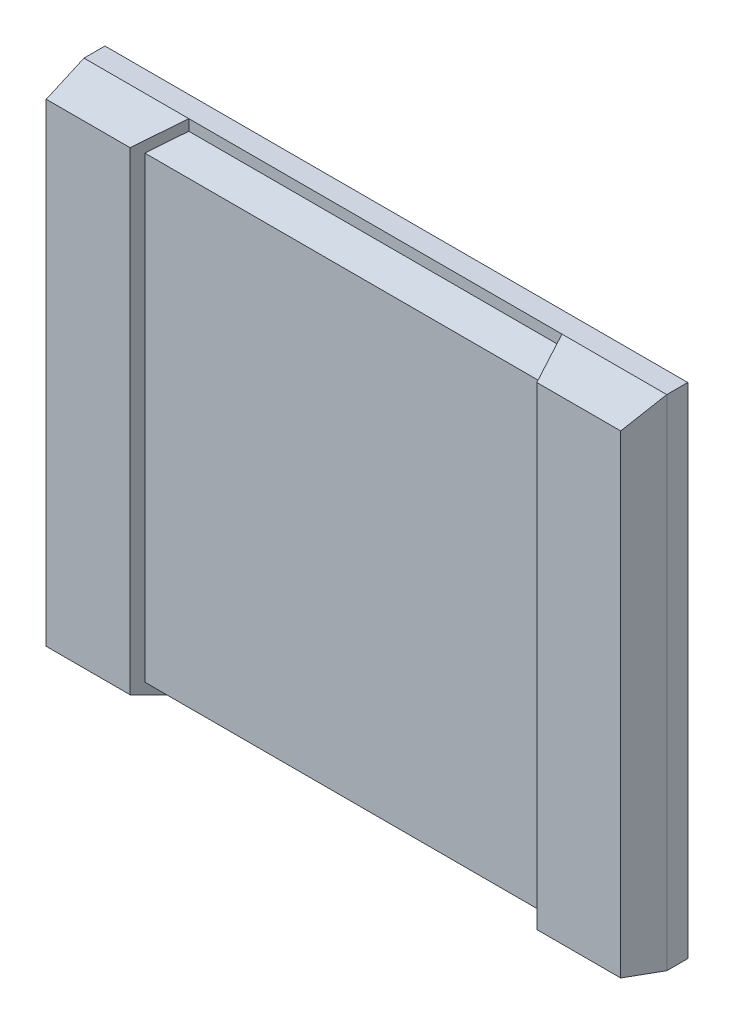
ISO-10303-21;
HEADER;
FILE_DESCRIPTION(('STEP AP214'),'2;1');
FILE_NAME('part.step','',(''),(''),'','','');
FILE_SCHEMA(('AUTOMOTIVE_DESIGN { 1 0 10303 214 1 1 1 1 }'));
ENDSEC;
DATA;
#1=APPLICATION_CONTEXT('core data for automotive mechanical design processes');
#2=APPLICATION_PROTOCOL_DEFINITION('international standard','automotive_design',2000,#1);
#3=PRODUCT_CONTEXT('',#1,'mechanical');
#4=PRODUCT('Part','Part','',(#3));
#5=PRODUCT_RELATED_PRODUCT_CATEGORY('part','',(#4));
#6=PRODUCT_DEFINITION_FORMATION('','',#4);
#7=PRODUCT_DEFINITION_CONTEXT('part definition',#1,'design');
#8=PRODUCT_DEFINITION('design','',#6,#7);
#9=PRODUCT_DEFINITION_SHAPE('','',#8);
#10=(LENGTH_UNIT() NAMED_UNIT(*) SI_UNIT(.MILLI.,.METRE.));
#11=(NAMED_UNIT(*) PLANE_ANGLE_UNIT() SI_UNIT($,.RADIAN.));
#12=(NAMED_UNIT(*) SI_UNIT($,.STERADIAN.) SOLID_ANGLE_UNIT());
#13=UNCERTAINTY_MEASURE_WITH_UNIT(LENGTH_MEASURE(1.E-05),#10,'distance_accuracy_value','');
#14=(GEOMETRIC_REPRESENTATION_CONTEXT(3) GLOBAL_UNCERTAINTY_ASSIGNED_CONTEXT((#13)) GLOBAL_UNIT_ASSIGNED_CONTEXT((#10,
#11,#12)) REPRESENTATION_CONTEXT('',''));
#15=CARTESIAN_POINT('',(0.,0.,0.));
#16=DIRECTION('',(0.,0.,1.));
#17=DIRECTION('',(1.,0.,0.));
#18=AXIS2_PLACEMENT_3D('',#15,#16,#17);
#19=CARTESIAN_POINT('',(0.,0.,15.));
#20=DIRECTION('',(0.,0.,1.));
#21=DIRECTION('',(1.,0.,0.));
#22=AXIS2_PLACEMENT_3D('',#19,#20,#21);
#23=PLANE('',#22);
#24=DIRECTION('',(1.,0.,0.));
#25=VECTOR('',#24,1.);
#26=CARTESIAN_POINT('',(-68.5,-56.5,15.));
#27=LINE('',#26,#25);
#28=CARTESIAN_POINT('',(-68.5,-56.5,15.));
#29=VERTEX_POINT('',#28);
#30=CARTESIAN_POINT('',(-48.5,-56.5,15.));
#31=VERTEX_POINT('',#30);
#32=EDGE_CURVE('E166',#29,#31,#27,.T.);
#33=ORIENTED_EDGE('',*,*,#32,.T.);
#34=DIRECTION('',(0.,1.,0.));
#35=VECTOR('',#34,1.);
#36=CARTESIAN_POINT('',(-48.5,-46.7709828525953,15.));
#37=LINE('',#36,#35);
#38=CARTESIAN_POINT('',(-48.5,56.5,15.));
#39=VERTEX_POINT('',#38);
#40=EDGE_CURVE('E147',#31,#39,#37,.T.);
#41=ORIENTED_EDGE('',*,*,#40,.T.);
#42=DIRECTION('',(-1.,0.,0.));
#43=VECTOR('',#42,1.);
#44=CARTESIAN_POINT('',(-68.5,56.5,15.));
#45=LINE('',#44,#43);
#46=CARTESIAN_POINT('',(-68.5,56.5,15.));
#47=VERTEX_POINT('',#46);
#48=EDGE_CURVE('E229',#39,#47,#45,.T.);
#49=ORIENTED_EDGE('',*,*,#48,.T.);
#50=DIRECTION('',(0.,-1.,0.));
#51=VECTOR('',#50,1.);
#52=CARTESIAN_POINT('',(-68.5,56.5,15.));
#53=LINE('',#52,#51);
#54=EDGE_CURVE('E176',#47,#29,#53,.T.);
#55=ORIENTED_EDGE('',*,*,#54,.T.);
#56=EDGE_LOOP('',(#33,#41,#49,#55));
#57=FACE_BOUND('',#56,.T.);
#58=ADVANCED_FACE('F45',(#57),#23,.T.);
#59=CARTESIAN_POINT('',(0.,53.5687370392407,16.0706211117723));
#60=DIRECTION('',(0.,-0.957826285221151,-0.287347885566347));
#61=DIRECTION('',(0.,0.287347885566347,-0.957826285221151));
#62=AXIS2_PLACEMENT_3D('',#59,#60,#61);
#63=PLANE('',#62);
#64=DIRECTION('',(-1.,0.,0.));
#65=VECTOR('',#64,1.);
#66=CARTESIAN_POINT('',(0.,54.6399233727724,12.5));
#67=LINE('',#66,#65);
#68=CARTESIAN_POINT('',(47.5,54.6399233727723,12.5));
#69=VERTEX_POINT('',#68);
#70=CARTESIAN_POINT('',(-47.5,54.6399233727723,12.5));
#71=VERTEX_POINT('',#70);
#72=EDGE_CURVE('E234',#69,#71,#67,.T.);
#73=ORIENTED_EDGE('',*,*,#72,.F.);
#74=DIRECTION('',(-0.357770876399965,0.268328157299976,-0.894427190999916));
#75=VECTOR('',#74,1.);
#76=CARTESIAN_POINT('',(58.1634469976353,46.6423381245458,39.1586174940884));
#77=LINE('',#76,#75);
#78=CARTESIAN_POINT('',(44.5,56.8899233727724,5.));
#79=VERTEX_POINT('',#78);
#80=EDGE_CURVE('E62',#69,#79,#77,.T.);
#81=ORIENTED_EDGE('',*,*,#80,.T.);
#82=DIRECTION('',(-1.,0.,0.));
#83=VECTOR('',#82,1.);
#84=CARTESIAN_POINT('',(44.5,56.8899233727724,5.));
#85=LINE('',#84,#83);
#86=CARTESIAN_POINT('',(-44.5,56.8899233727724,5.));
#87=VERTEX_POINT('',#86);
#88=EDGE_CURVE('E379',#79,#87,#85,.T.);
#89=ORIENTED_EDGE('',*,*,#88,.T.);
#90=DIRECTION('',(-0.357770876399966,-0.268328157299976,0.894427190999916));
#91=VECTOR('',#90,1.);
#92=CARTESIAN_POINT('',(-58.1634469976353,46.6423381245458,39.1586174940884));
#93=LINE('',#92,#91);
#94=EDGE_CURVE('E160',#87,#71,#93,.T.);
#95=ORIENTED_EDGE('',*,*,#94,.T.);
#96=EDGE_LOOP('',(#73,#81,#89,#95));
#97=FACE_BOUND('',#96,.T.);
#98=ADVANCED_FACE('F395',(#97),#63,.F.);
#99=CARTESIAN_POINT('',(0.,-53.5687370392407,16.0706211117723));
#100=DIRECTION('',(0.,0.957826285221151,-0.287347885566347));
#101=DIRECTION('',(0.,-0.287347885566347,-0.957826285221151));
#102=AXIS2_PLACEMENT_3D('',#99,#100,#101);
#103=PLANE('',#102);
#104=DIRECTION('',(1.,0.,0.));
#105=VECTOR('',#104,1.);
#106=CARTESIAN_POINT('',(0.,-54.6399233727724,12.5));
#107=LINE('',#106,#105);
#108=CARTESIAN_POINT('',(-47.5,-54.6399233727723,12.5));
#109=VERTEX_POINT('',#108);
#110=CARTESIAN_POINT('',(47.5,-54.6399233727723,12.5));
#111=VERTEX_POINT('',#110);
#112=EDGE_CURVE('E13',#109,#111,#107,.T.);
#113=ORIENTED_EDGE('',*,*,#112,.F.);
#114=DIRECTION('',(-0.357770876399966,0.268328157299976,0.894427190999916));
#115=VECTOR('',#114,1.);
#116=CARTESIAN_POINT('',(-58.1634469976353,-46.6423381245458,39.1586174940884));
#117=LINE('',#116,#115);
#118=CARTESIAN_POINT('',(-44.5,-56.8899233727724,5.));
#119=VERTEX_POINT('',#118);
#120=EDGE_CURVE('E172',#119,#109,#117,.T.);
#121=ORIENTED_EDGE('',*,*,#120,.F.);
#122=DIRECTION('',(-1.,0.,0.));
#123=VECTOR('',#122,1.);
#124=CARTESIAN_POINT('',(44.5,-56.8899233727724,5.));
#125=LINE('',#124,#123);
#126=CARTESIAN_POINT('',(44.5,-56.8899233727724,5.));
#127=VERTEX_POINT('',#126);
#128=EDGE_CURVE('E416',#127,#119,#125,.T.);
#129=ORIENTED_EDGE('',*,*,#128,.F.);
#130=DIRECTION('',(-0.357770876399965,-0.268328157299976,-0.894427190999916));
#131=VECTOR('',#130,1.);
#132=CARTESIAN_POINT('',(58.1634469976353,-46.6423381245458,39.1586174940884));
#133=LINE('',#132,#131);
#134=EDGE_CURVE('E411',#111,#127,#133,.T.);
#135=ORIENTED_EDGE('',*,*,#134,.F.);
#136=EDGE_LOOP('',(#113,#121,#129,#135));
#137=FACE_BOUND('',#136,.T.);
#138=ADVANCED_FACE('F399',(#137),#103,.F.);
#139=CARTESIAN_POINT('',(0.,-55.9633027522936,16.788990825688));
#140=DIRECTION('',(0.,0.957826285221152,-0.287347885566343));
#141=DIRECTION('',(0.,0.287347885566343,0.957826285221152));
#142=AXIS2_PLACEMENT_3D('',#139,#140,#141);
#143=PLANE('',#142);
#144=CARTESIAN_POINT('',(48.5,-56.5,15.));
#145=VERTEX_POINT('',#144);
#146=CARTESIAN_POINT('',(68.5,-56.5,15.));
#147=VERTEX_POINT('',#146);
#148=EDGE_CURVE('E178',#145,#147,#27,.T.);
#149=ORIENTED_EDGE('',*,*,#148,.F.);
#150=DIRECTION('',(0.357770876399965,0.268328157299976,0.894427190999916));
#151=VECTOR('',#150,1.);
#152=CARTESIAN_POINT('',(42.9160000000001,-60.688,1.04000000000012));
#153=LINE('',#152,#151);
#154=CARTESIAN_POINT('',(44.5,-59.5,5.));
#155=VERTEX_POINT('',#154);
#156=EDGE_CURVE('E171',#155,#145,#153,.T.);
#157=ORIENTED_EDGE('',*,*,#156,.F.);
#158=DIRECTION('',(1.,0.,0.));
#159=VECTOR('',#158,1.);
#160=CARTESIAN_POINT('',(0.,-59.5,5.));
#161=LINE('',#160,#159);
#162=CARTESIAN_POINT('',(69.5,-59.5,5.));
#163=VERTEX_POINT('',#162);
#164=EDGE_CURVE('E341',#155,#163,#161,.T.);
#165=ORIENTED_EDGE('',*,*,#164,.T.);
#166=DIRECTION('',(-0.0953462589245607,0.286038776773676,0.953462589245593));
#167=VECTOR('',#166,1.);
#168=CARTESIAN_POINT('',(69.5,-59.5,5.));
#169=LINE('',#168,#167);
#170=EDGE_CURVE('E254',#163,#147,#169,.T.);
#171=ORIENTED_EDGE('',*,*,#170,.T.);
#172=EDGE_LOOP('',(#149,#157,#165,#171));
#173=FACE_BOUND('',#172,.T.);
#174=ADVANCED_FACE('F306',(#173),#143,.F.);
#175=CARTESIAN_POINT('',(0.,55.9633027522935,16.7889908256882));
#176=DIRECTION('',(0.,-0.957826285221151,-0.287347885566347));
#177=DIRECTION('',(0.,0.287347885566347,-0.957826285221151));
#178=AXIS2_PLACEMENT_3D('',#175,#176,#177);
#179=PLANE('',#178);
#180=DIRECTION('',(1.,0.,0.));
#181=VECTOR('',#180,1.);
#182=CARTESIAN_POINT('',(0.,59.5,5.));
#183=LINE('',#182,#181);
#184=CARTESIAN_POINT('',(69.5,59.5,5.));
#185=VERTEX_POINT('',#184);
#186=CARTESIAN_POINT('',(44.5,59.5,5.));
#187=VERTEX_POINT('',#186);
#188=EDGE_CURVE('E342',#185,#187,#183,.F.);
#189=ORIENTED_EDGE('',*,*,#188,.T.);
#190=DIRECTION('',(0.357770876399965,-0.268328157299976,0.894427190999916));
#191=VECTOR('',#190,1.);
#192=CARTESIAN_POINT('',(42.9160000000001,60.688,1.04000000000012));
#193=LINE('',#192,#191);
#194=CARTESIAN_POINT('',(48.5,56.5,15.));
#195=VERTEX_POINT('',#194);
#196=EDGE_CURVE('E54',#187,#195,#193,.T.);
#197=ORIENTED_EDGE('',*,*,#196,.T.);
#198=CARTESIAN_POINT('',(68.5,56.5,15.));
#199=VERTEX_POINT('',#198);
#200=EDGE_CURVE('E249',#199,#195,#45,.T.);
#201=ORIENTED_EDGE('',*,*,#200,.F.);
#202=DIRECTION('',(-0.0953462589245606,-0.286038776773679,0.953462589245592));
#203=VECTOR('',#202,1.);
#204=CARTESIAN_POINT('',(69.5,59.5,5.));
#205=LINE('',#204,#203);
#206=EDGE_CURVE('E253',#185,#199,#205,.T.);
#207=ORIENTED_EDGE('',*,*,#206,.F.);
#208=EDGE_LOOP('',(#189,#197,#201,#207));
#209=FACE_BOUND('',#208,.T.);
#210=ADVANCED_FACE('F301',(#209),#179,.F.);
#211=CARTESIAN_POINT('',(69.5,59.5,5.));
#212=DIRECTION('',(-1.,0.,0.));
#213=DIRECTION('',(0.,0.,1.));
#214=AXIS2_PLACEMENT_3D('',#211,#212,#213);
#215=PLANE('',#214);
#216=DIRECTION('',(0.,1.,0.));
#217=VECTOR('',#216,1.);
#218=CARTESIAN_POINT('',(69.5,59.5,0.));
#219=LINE('',#218,#217);
#220=CARTESIAN_POINT('',(69.5,-59.5,0.));
#221=VERTEX_POINT('',#220);
#222=CARTESIAN_POINT('',(69.5,59.5,0.));
#223=VERTEX_POINT('',#222);
#224=EDGE_CURVE('E273',#221,#223,#219,.T.);
#225=ORIENTED_EDGE('',*,*,#224,.T.);
#226=DIRECTION('',(0.,0.,-1.));
#227=VECTOR('',#226,1.);
#228=CARTESIAN_POINT('',(69.5,59.5,5.));
#229=LINE('',#228,#227);
#230=EDGE_CURVE('E328',#185,#223,#229,.T.);
#231=ORIENTED_EDGE('',*,*,#230,.F.);
#232=DIRECTION('',(0.,1.,0.));
#233=VECTOR('',#232,1.);
#234=CARTESIAN_POINT('',(69.5,0.,5.));
#235=LINE('',#234,#233);
#236=EDGE_CURVE('E345',#163,#185,#235,.T.);
#237=ORIENTED_EDGE('',*,*,#236,.F.);
#238=DIRECTION('',(0.,0.,-1.));
#239=VECTOR('',#238,1.);
#240=CARTESIAN_POINT('',(69.5,-59.5,5.));
#241=LINE('',#240,#239);
#242=EDGE_CURVE('E348',#163,#221,#241,.T.);
#243=ORIENTED_EDGE('',*,*,#242,.T.);
#244=EDGE_LOOP('',(#225,#231,#237,#243));
#245=FACE_BOUND('',#244,.T.);
#246=ADVANCED_FACE('F47',(#245),#215,.F.);
#247=CARTESIAN_POINT('',(-69.5,59.5,5.));
#248=DIRECTION('',(0.,-1.,0.));
#249=DIRECTION('',(0.,0.,-1.));
#250=AXIS2_PLACEMENT_3D('',#247,#248,#249);
#251=PLANE('',#250);
#252=DIRECTION('',(-1.,0.,0.));
#253=VECTOR('',#252,1.);
#254=CARTESIAN_POINT('',(-69.5,59.5,0.));
#255=LINE('',#254,#253);
#256=CARTESIAN_POINT('',(-69.5,59.5,0.));
#257=VERTEX_POINT('',#256);
#258=EDGE_CURVE('E276',#223,#257,#255,.T.);
#259=ORIENTED_EDGE('',*,*,#258,.T.);
#260=DIRECTION('',(0.,0.,-1.));
#261=VECTOR('',#260,1.);
#262=CARTESIAN_POINT('',(-69.5,59.5,5.));
#263=LINE('',#262,#261);
#264=CARTESIAN_POINT('',(-69.5,59.5,5.));
#265=VERTEX_POINT('',#264);
#266=EDGE_CURVE('E330',#265,#257,#263,.T.);
#267=ORIENTED_EDGE('',*,*,#266,.F.);
#268=CARTESIAN_POINT('',(-44.5,59.5,5.));
#269=VERTEX_POINT('',#268);
#270=EDGE_CURVE('E271',#269,#265,#183,.F.);
#271=ORIENTED_EDGE('',*,*,#270,.F.);
#272=DIRECTION('',(-1.,0.,0.));
#273=VECTOR('',#272,1.);
#274=CARTESIAN_POINT('',(44.5,59.5,5.));
#275=LINE('',#274,#273);
#276=EDGE_CURVE('E365',#187,#269,#275,.T.);
#277=ORIENTED_EDGE('',*,*,#276,.F.);
#278=ORIENTED_EDGE('',*,*,#188,.F.);
#279=ORIENTED_EDGE('',*,*,#230,.T.);
#280=EDGE_LOOP('',(#259,#267,#271,#277,#278,#279));
#281=FACE_BOUND('',#280,.T.);
#282=ADVANCED_FACE('F364',(#281),#251,.F.);
#283=CARTESIAN_POINT('',(-69.5,59.5,5.));
#284=DIRECTION('',(1.,0.,0.));
#285=DIRECTION('',(0.,1.,0.));
#286=AXIS2_PLACEMENT_3D('',#283,#284,#285);
#287=PLANE('',#286);
#288=DIRECTION('',(0.,-1.,0.));
#289=VECTOR('',#288,1.);
#290=CARTESIAN_POINT('',(-69.5,59.5,0.));
#291=LINE('',#290,#289);
#292=CARTESIAN_POINT('',(-69.5,-59.5,0.));
#293=VERTEX_POINT('',#292);
#294=EDGE_CURVE('E433',#257,#293,#291,.T.);
#295=ORIENTED_EDGE('',*,*,#294,.T.);
#296=DIRECTION('',(0.,0.,-1.));
#297=VECTOR('',#296,1.);
#298=CARTESIAN_POINT('',(-69.5,-59.5,5.));
#299=LINE('',#298,#297);
#300=CARTESIAN_POINT('',(-69.5,-59.5,5.));
#301=VERTEX_POINT('',#300);
#302=EDGE_CURVE('E335',#301,#293,#299,.T.);
#303=ORIENTED_EDGE('',*,*,#302,.F.);
#304=DIRECTION('',(0.,1.,0.));
#305=VECTOR('',#304,1.);
#306=CARTESIAN_POINT('',(-69.5,0.,5.));
#307=LINE('',#306,#305);
#308=EDGE_CURVE('E339',#265,#301,#307,.F.);
#309=ORIENTED_EDGE('',*,*,#308,.F.);
#310=ORIENTED_EDGE('',*,*,#266,.T.);
#311=EDGE_LOOP('',(#295,#303,#309,#310));
#312=FACE_BOUND('',#311,.T.);
#313=ADVANCED_FACE('F431',(#312),#287,.F.);
#314=CARTESIAN_POINT('',(-69.5,-59.5,5.));
#315=DIRECTION('',(0.,1.,0.));
#316=DIRECTION('',(0.,0.,1.));
#317=AXIS2_PLACEMENT_3D('',#314,#315,#316);
#318=PLANE('',#317);
#319=DIRECTION('',(1.,0.,0.));
#320=VECTOR('',#319,1.);
#321=CARTESIAN_POINT('',(-69.5,-59.5,0.));
#322=LINE('',#321,#320);
#323=EDGE_CURVE('E347',#293,#221,#322,.T.);
#324=ORIENTED_EDGE('',*,*,#323,.T.);
#325=ORIENTED_EDGE('',*,*,#242,.F.);
#326=ORIENTED_EDGE('',*,*,#164,.F.);
#327=DIRECTION('',(-1.,0.,0.));
#328=VECTOR('',#327,1.);
#329=CARTESIAN_POINT('',(44.5,-59.5,5.));
#330=LINE('',#329,#328);
#331=CARTESIAN_POINT('',(-44.5,-59.5,5.));
#332=VERTEX_POINT('',#331);
#333=EDGE_CURVE('E406',#155,#332,#330,.T.);
#334=ORIENTED_EDGE('',*,*,#333,.T.);
#335=EDGE_CURVE('E170',#301,#332,#161,.T.);
#336=ORIENTED_EDGE('',*,*,#335,.F.);
#337=ORIENTED_EDGE('',*,*,#302,.T.);
#338=EDGE_LOOP('',(#324,#325,#326,#334,#336,#337));
#339=FACE_BOUND('',#338,.T.);
#340=ADVANCED_FACE('F360',(#339),#318,.F.);
#341=CARTESIAN_POINT('',(0.,0.,0.));
#342=DIRECTION('',(0.,0.,1.));
#343=DIRECTION('',(1.,0.,0.));
#344=AXIS2_PLACEMENT_3D('',#341,#342,#343);
#345=PLANE('',#344);
#346=ORIENTED_EDGE('',*,*,#224,.F.);
#347=ORIENTED_EDGE('',*,*,#323,.F.);
#348=ORIENTED_EDGE('',*,*,#294,.F.);
#349=ORIENTED_EDGE('',*,*,#258,.F.);
#350=EDGE_LOOP('',(#346,#347,#348,#349));
#351=FACE_BOUND('',#350,.T.);
#352=ADVANCED_FACE('F202',(#351),#345,.F.);
#353=DIRECTION('',(0.,1.,0.));
#354=VECTOR('',#353,1.);
#355=CARTESIAN_POINT('',(48.5,-46.7709828525953,15.));
#356=LINE('',#355,#354);
#357=EDGE_CURVE('E159',#145,#195,#356,.T.);
#358=ORIENTED_EDGE('',*,*,#357,.F.);
#359=ORIENTED_EDGE('',*,*,#148,.T.);
#360=DIRECTION('',(0.,1.,0.));
#361=VECTOR('',#360,1.);
#362=CARTESIAN_POINT('',(68.5,56.5,15.));
#363=LINE('',#362,#361);
#364=EDGE_CURVE('E237',#147,#199,#363,.T.);
#365=ORIENTED_EDGE('',*,*,#364,.T.);
#366=ORIENTED_EDGE('',*,*,#200,.T.);
#367=EDGE_LOOP('',(#358,#359,#365,#366));
#368=FACE_BOUND('',#367,.T.);
#369=ADVANCED_FACE('F191',(#368),#23,.T.);
#370=CARTESIAN_POINT('',(-69.3069306930693,0.,6.93069306930704));
#371=DIRECTION('',(0.995037190209989,0.,-0.0995037190210004));
#372=DIRECTION('',(-0.0995037190210005,0.,-0.995037190209989));
#373=AXIS2_PLACEMENT_3D('',#370,#371,#372);
#374=PLANE('',#373);
#375=DIRECTION('',(0.0953462589245607,0.286038776773676,0.953462589245593));
#376=VECTOR('',#375,1.);
#377=CARTESIAN_POINT('',(-69.5,-59.5,5.));
#378=LINE('',#377,#376);
#379=EDGE_CURVE('E266',#301,#29,#378,.T.);
#380=ORIENTED_EDGE('',*,*,#379,.T.);
#381=ORIENTED_EDGE('',*,*,#54,.F.);
#382=DIRECTION('',(0.095346258924558,-0.286038776773679,0.953462589245592));
#383=VECTOR('',#382,1.);
#384=CARTESIAN_POINT('',(-69.5,59.5,5.));
#385=LINE('',#384,#383);
#386=EDGE_CURVE('E265',#265,#47,#385,.T.);
#387=ORIENTED_EDGE('',*,*,#386,.F.);
#388=ORIENTED_EDGE('',*,*,#308,.T.);
#389=EDGE_LOOP('',(#380,#381,#387,#388));
#390=FACE_BOUND('',#389,.T.);
#391=ADVANCED_FACE('F201',(#390),#374,.F.);
#392=ORIENTED_EDGE('',*,*,#48,.F.);
#393=DIRECTION('',(0.357770876399966,0.268328157299976,-0.894427190999916));
#394=VECTOR('',#393,1.);
#395=CARTESIAN_POINT('',(-42.9160000000001,60.688,1.04000000000009));
#396=LINE('',#395,#394);
#397=EDGE_CURVE('E155',#39,#269,#396,.T.);
#398=ORIENTED_EDGE('',*,*,#397,.T.);
#399=ORIENTED_EDGE('',*,*,#270,.T.);
#400=ORIENTED_EDGE('',*,*,#386,.T.);
#401=EDGE_LOOP('',(#392,#398,#399,#400));
#402=FACE_BOUND('',#401,.T.);
#403=ADVANCED_FACE('F269',(#402),#179,.F.);
#404=ORIENTED_EDGE('',*,*,#335,.T.);
#405=DIRECTION('',(0.357770876399966,-0.268328157299976,-0.894427190999916));
#406=VECTOR('',#405,1.);
#407=CARTESIAN_POINT('',(-42.9160000000001,-60.688,1.04000000000009));
#408=LINE('',#407,#406);
#409=EDGE_CURVE('E151',#31,#332,#408,.T.);
#410=ORIENTED_EDGE('',*,*,#409,.F.);
#411=ORIENTED_EDGE('',*,*,#32,.F.);
#412=ORIENTED_EDGE('',*,*,#379,.F.);
#413=EDGE_LOOP('',(#404,#410,#411,#412));
#414=FACE_BOUND('',#413,.T.);
#415=ADVANCED_FACE('F164',(#414),#143,.F.);
#416=CARTESIAN_POINT('',(69.3069306930693,0.,6.93069306930703));
#417=DIRECTION('',(-0.995037190209989,0.,-0.0995037190210004));
#418=DIRECTION('',(-0.0995037190210004,0.,0.995037190209989));
#419=AXIS2_PLACEMENT_3D('',#416,#417,#418);
#420=PLANE('',#419);
#421=ORIENTED_EDGE('',*,*,#206,.T.);
#422=ORIENTED_EDGE('',*,*,#364,.F.);
#423=ORIENTED_EDGE('',*,*,#170,.F.);
#424=ORIENTED_EDGE('',*,*,#236,.T.);
#425=EDGE_LOOP('',(#421,#422,#423,#424));
#426=FACE_BOUND('',#425,.T.);
#427=ADVANCED_FACE('F204',(#426),#420,.F.);
#428=CARTESIAN_POINT('',(48.5,-46.7709828525953,15.));
#429=DIRECTION('',(0.92847669088526,0.,-0.371390676354103));
#430=DIRECTION('',(-0.371390676354103,0.,-0.92847669088526));
#431=AXIS2_PLACEMENT_3D('',#428,#429,#430);
#432=PLANE('',#431);
#433=ORIENTED_EDGE('',*,*,#357,.T.);
#434=ORIENTED_EDGE('',*,*,#196,.F.);
#435=DIRECTION('',(0.,1.,0.));
#436=VECTOR('',#435,1.);
#437=CARTESIAN_POINT('',(44.5,-46.7709828525953,5.));
#438=LINE('',#437,#436);
#439=EDGE_CURVE('E370',#79,#187,#438,.T.);
#440=ORIENTED_EDGE('',*,*,#439,.F.);
#441=ORIENTED_EDGE('',*,*,#80,.F.);
#442=DIRECTION('',(0.,-1.,0.));
#443=VECTOR('',#442,1.);
#444=CARTESIAN_POINT('',(47.5,0.,12.5));
#445=LINE('',#444,#443);
#446=EDGE_CURVE('E231',#111,#69,#445,.F.);
#447=ORIENTED_EDGE('',*,*,#446,.F.);
#448=ORIENTED_EDGE('',*,*,#134,.T.);
#449=DIRECTION('',(0.,-1.,0.));
#450=VECTOR('',#449,1.);
#451=CARTESIAN_POINT('',(44.5,46.7709828525953,5.));
#452=LINE('',#451,#450);
#453=EDGE_CURVE('E414',#127,#155,#452,.T.);
#454=ORIENTED_EDGE('',*,*,#453,.T.);
#455=ORIENTED_EDGE('',*,*,#156,.T.);
#456=EDGE_LOOP('',(#433,#434,#440,#441,#447,#448,#454,#455));
#457=FACE_BOUND('',#456,.T.);
#458=ADVANCED_FACE('F385',(#457),#432,.F.);
#459=CARTESIAN_POINT('',(-48.5,-46.7709828525953,15.));
#460=DIRECTION('',(-0.928476690885259,0.,-0.371390676354104));
#461=DIRECTION('',(-0.371390676354104,0.,0.928476690885259));
#462=AXIS2_PLACEMENT_3D('',#459,#460,#461);
#463=PLANE('',#462);
#464=ORIENTED_EDGE('',*,*,#40,.F.);
#465=ORIENTED_EDGE('',*,*,#409,.T.);
#466=DIRECTION('',(0.,-1.,0.));
#467=VECTOR('',#466,1.);
#468=CARTESIAN_POINT('',(-44.5,46.7709828525953,5.));
#469=LINE('',#468,#467);
#470=EDGE_CURVE('E420',#119,#332,#469,.T.);
#471=ORIENTED_EDGE('',*,*,#470,.F.);
#472=ORIENTED_EDGE('',*,*,#120,.T.);
#473=DIRECTION('',(0.,1.,0.));
#474=VECTOR('',#473,1.);
#475=CARTESIAN_POINT('',(-47.5,0.,12.5));
#476=LINE('',#475,#474);
#477=EDGE_CURVE('E69',#71,#109,#476,.F.);
#478=ORIENTED_EDGE('',*,*,#477,.F.);
#479=ORIENTED_EDGE('',*,*,#94,.F.);
#480=DIRECTION('',(0.,1.,0.));
#481=VECTOR('',#480,1.);
#482=CARTESIAN_POINT('',(-44.5,-46.7709828525953,5.));
#483=LINE('',#482,#481);
#484=EDGE_CURVE('E378',#87,#269,#483,.T.);
#485=ORIENTED_EDGE('',*,*,#484,.T.);
#486=ORIENTED_EDGE('',*,*,#397,.F.);
#487=EDGE_LOOP('',(#464,#465,#471,#472,#478,#479,#485,#486));
#488=FACE_BOUND('',#487,.T.);
#489=ADVANCED_FACE('F149',(#488),#463,.F.);
#490=CARTESIAN_POINT('',(44.5,-46.7709828525953,5.));
#491=DIRECTION('',(0.,0.,-1.));
#492=DIRECTION('',(-1.,0.,0.));
#493=AXIS2_PLACEMENT_3D('',#490,#491,#492);
#494=PLANE('',#493);
#495=ORIENTED_EDGE('',*,*,#439,.T.);
#496=ORIENTED_EDGE('',*,*,#276,.T.);
#497=ORIENTED_EDGE('',*,*,#484,.F.);
#498=ORIENTED_EDGE('',*,*,#88,.F.);
#499=EDGE_LOOP('',(#495,#496,#497,#498));
#500=FACE_BOUND('',#499,.T.);
#501=ADVANCED_FACE('F384',(#500),#494,.F.);
#502=CARTESIAN_POINT('',(44.5,46.7709828525953,5.));
#503=DIRECTION('',(0.,0.,-1.));
#504=DIRECTION('',(-1.,0.,0.));
#505=AXIS2_PLACEMENT_3D('',#502,#503,#504);
#506=PLANE('',#505);
#507=ORIENTED_EDGE('',*,*,#453,.F.);
#508=ORIENTED_EDGE('',*,*,#128,.T.);
#509=ORIENTED_EDGE('',*,*,#470,.T.);
#510=ORIENTED_EDGE('',*,*,#333,.F.);
#511=EDGE_LOOP('',(#507,#508,#509,#510));
#512=FACE_BOUND('',#511,.T.);
#513=ADVANCED_FACE('F422',(#512),#506,.F.);
#514=CARTESIAN_POINT('',(0.,0.,12.5));
#515=DIRECTION('',(0.,0.,1.));
#516=DIRECTION('',(1.,0.,0.));
#517=AXIS2_PLACEMENT_3D('',#514,#515,#516);
#518=PLANE('',#517);
#519=ORIENTED_EDGE('',*,*,#446,.T.);
#520=ORIENTED_EDGE('',*,*,#72,.T.);
#521=ORIENTED_EDGE('',*,*,#477,.T.);
#522=ORIENTED_EDGE('',*,*,#112,.T.);
#523=EDGE_LOOP('',(#519,#520,#521,#522));
#524=FACE_BOUND('',#523,.T.);
#525=ADVANCED_FACE('F408',(#524),#518,.T.);
#526=CLOSED_SHELL('',(#58,#98,#138,#174,#210,#246,#282,#313,#340,#352,#369,#391,#403,#415,#427,
#458,#489,#501,#513,#525));
#527=MANIFOLD_SOLID_BREP('B2',#526);
#528=ADVANCED_BREP_SHAPE_REPRESENTATION('',(#18,#527),#14);
#529=SHAPE_DEFINITION_REPRESENTATION(#9,#528);
ENDSEC;
END-ISO-10303-21;
